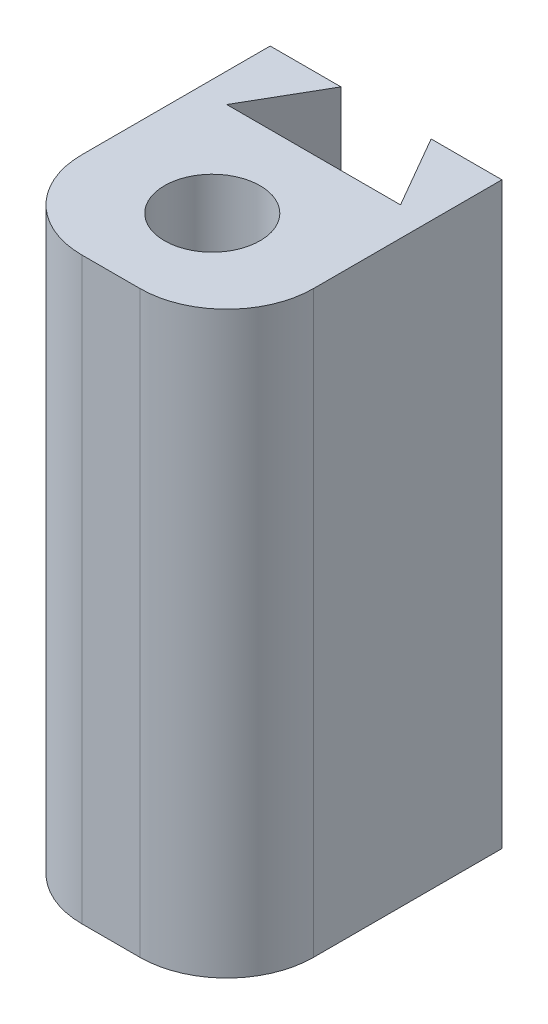
ISO-10303-21;
HEADER;
FILE_DESCRIPTION(('STEP AP214'),'2;1');
FILE_NAME('part.step','',(''),(''),'','','');
FILE_SCHEMA(('AUTOMOTIVE_DESIGN { 1 0 10303 214 1 1 1 1 }'));
ENDSEC;
DATA;
#1=APPLICATION_CONTEXT('core data for automotive mechanical design processes');
#2=APPLICATION_PROTOCOL_DEFINITION('international standard','automotive_design',2000,#1);
#3=PRODUCT_CONTEXT('',#1,'mechanical');
#4=PRODUCT('Part','Part','',(#3));
#5=PRODUCT_RELATED_PRODUCT_CATEGORY('part','',(#4));
#6=PRODUCT_DEFINITION_FORMATION('','',#4);
#7=PRODUCT_DEFINITION_CONTEXT('part definition',#1,'design');
#8=PRODUCT_DEFINITION('design','',#6,#7);
#9=PRODUCT_DEFINITION_SHAPE('','',#8);
#10=(LENGTH_UNIT() NAMED_UNIT(*) SI_UNIT(.MILLI.,.METRE.));
#11=(NAMED_UNIT(*) PLANE_ANGLE_UNIT() SI_UNIT($,.RADIAN.));
#12=(NAMED_UNIT(*) SI_UNIT($,.STERADIAN.) SOLID_ANGLE_UNIT());
#13=UNCERTAINTY_MEASURE_WITH_UNIT(LENGTH_MEASURE(1.E-05),#10,'distance_accuracy_value','');
#14=(GEOMETRIC_REPRESENTATION_CONTEXT(3) GLOBAL_UNCERTAINTY_ASSIGNED_CONTEXT((#13)) GLOBAL_UNIT_ASSIGNED_CONTEXT((#10,
#11,#12)) REPRESENTATION_CONTEXT('',''));
#15=CARTESIAN_POINT('',(0.,0.,0.));
#16=DIRECTION('',(0.,0.,1.));
#17=DIRECTION('',(1.,0.,0.));
#18=AXIS2_PLACEMENT_3D('',#15,#16,#17);
#19=CARTESIAN_POINT('',(0.,1.,-12.));
#20=DIRECTION('',(0.,0.,-1.));
#21=DIRECTION('',(-1.,0.,0.));
#22=AXIS2_PLACEMENT_3D('',#19,#20,#21);
#23=PLANE('',#22);
#24=DIRECTION('',(1.,0.,0.));
#25=VECTOR('',#24,1.);
#26=CARTESIAN_POINT('',(0.,-19.,-12.));
#27=LINE('',#26,#25);
#28=CARTESIAN_POINT('',(-4.00000000000001,-19.,-12.));
#29=VERTEX_POINT('',#28);
#30=CARTESIAN_POINT('',(-1.55662432702584,-19.,-12.));
#31=VERTEX_POINT('',#30);
#32=EDGE_CURVE('E124',#29,#31,#27,.T.);
#33=ORIENTED_EDGE('',*,*,#32,.F.);
#34=DIRECTION('',(0.,-1.,0.));
#35=VECTOR('',#34,1.);
#36=CARTESIAN_POINT('',(-4.00000000000001,1.,-12.));
#37=LINE('',#36,#35);
#38=CARTESIAN_POINT('',(-4.00000000000001,1.,-12.));
#39=VERTEX_POINT('',#38);
#40=EDGE_CURVE('E119',#39,#29,#37,.T.);
#41=ORIENTED_EDGE('',*,*,#40,.F.);
#42=DIRECTION('',(1.,0.,0.));
#43=VECTOR('',#42,1.);
#44=CARTESIAN_POINT('',(0.,1.,-12.));
#45=LINE('',#44,#43);
#46=CARTESIAN_POINT('',(-1.55662432702584,1.,-12.));
#47=VERTEX_POINT('',#46);
#48=EDGE_CURVE('E121',#39,#47,#45,.T.);
#49=ORIENTED_EDGE('',*,*,#48,.T.);
#50=DIRECTION('',(0.,-1.,0.));
#51=VECTOR('',#50,1.);
#52=CARTESIAN_POINT('',(-1.55662432702584,1.,-12.));
#53=LINE('',#52,#51);
#54=EDGE_CURVE('E158',#47,#31,#53,.T.);
#55=ORIENTED_EDGE('',*,*,#54,.T.);
#56=EDGE_LOOP('',(#33,#41,#49,#55));
#57=FACE_BOUND('',#56,.T.);
#58=ADVANCED_FACE('F40',(#57),#23,.T.);
#59=CARTESIAN_POINT('',(-4.00000000000001,1.,0.));
#60=DIRECTION('',(1.,0.,0.));
#61=DIRECTION('',(0.,0.,-1.));
#62=AXIS2_PLACEMENT_3D('',#59,#60,#61);
#63=PLANE('',#62);
#64=DIRECTION('',(0.,0.,1.));
#65=VECTOR('',#64,1.);
#66=CARTESIAN_POINT('',(-4.00000000000001,-19.,0.));
#67=LINE('',#66,#65);
#68=CARTESIAN_POINT('',(-4.00000000000001,-19.,-5.5));
#69=VERTEX_POINT('',#68);
#70=EDGE_CURVE('E160',#29,#69,#67,.T.);
#71=ORIENTED_EDGE('',*,*,#70,.T.);
#72=DIRECTION('',(0.,-1.,0.));
#73=VECTOR('',#72,1.);
#74=CARTESIAN_POINT('',(-4.00000000000001,1.,-5.5));
#75=LINE('',#74,#73);
#76=CARTESIAN_POINT('',(-4.00000000000001,1.,-5.5));
#77=VERTEX_POINT('',#76);
#78=EDGE_CURVE('E63',#69,#77,#75,.F.);
#79=ORIENTED_EDGE('',*,*,#78,.T.);
#80=DIRECTION('',(0.,0.,1.));
#81=VECTOR('',#80,1.);
#82=CARTESIAN_POINT('',(-4.00000000000001,1.,0.));
#83=LINE('',#82,#81);
#84=EDGE_CURVE('E129',#39,#77,#83,.T.);
#85=ORIENTED_EDGE('',*,*,#84,.F.);
#86=ORIENTED_EDGE('',*,*,#40,.T.);
#87=EDGE_LOOP('',(#71,#79,#85,#86));
#88=FACE_BOUND('',#87,.T.);
#89=ADVANCED_FACE('F130',(#88),#63,.F.);
#90=CARTESIAN_POINT('',(3.99999999999999,1.,0.));
#91=DIRECTION('',(1.,0.,0.));
#92=DIRECTION('',(0.,0.,-1.));
#93=AXIS2_PLACEMENT_3D('',#90,#91,#92);
#94=PLANE('',#93);
#95=DIRECTION('',(0.,0.,1.));
#96=VECTOR('',#95,1.);
#97=CARTESIAN_POINT('',(3.99999999999999,1.,0.));
#98=LINE('',#97,#96);
#99=CARTESIAN_POINT('',(3.99999999999999,1.,-12.));
#100=VERTEX_POINT('',#99);
#101=CARTESIAN_POINT('',(3.99999999999999,1.,-5.5));
#102=VERTEX_POINT('',#101);
#103=EDGE_CURVE('E132',#100,#102,#98,.T.);
#104=ORIENTED_EDGE('',*,*,#103,.T.);
#105=DIRECTION('',(0.,1.,0.));
#106=VECTOR('',#105,1.);
#107=CARTESIAN_POINT('',(3.99999999999999,1.,-5.5));
#108=LINE('',#107,#106);
#109=CARTESIAN_POINT('',(3.99999999999999,-19.,-5.5));
#110=VERTEX_POINT('',#109);
#111=EDGE_CURVE('E11',#102,#110,#108,.F.);
#112=ORIENTED_EDGE('',*,*,#111,.T.);
#113=DIRECTION('',(0.,0.,1.));
#114=VECTOR('',#113,1.);
#115=CARTESIAN_POINT('',(3.99999999999999,-19.,0.));
#116=LINE('',#115,#114);
#117=CARTESIAN_POINT('',(3.99999999999999,-19.,-12.));
#118=VERTEX_POINT('',#117);
#119=EDGE_CURVE('E162',#118,#110,#116,.T.);
#120=ORIENTED_EDGE('',*,*,#119,.F.);
#121=DIRECTION('',(0.,-1.,0.));
#122=VECTOR('',#121,1.);
#123=CARTESIAN_POINT('',(3.99999999999999,1.,-12.));
#124=LINE('',#123,#122);
#125=EDGE_CURVE('E127',#100,#118,#124,.T.);
#126=ORIENTED_EDGE('',*,*,#125,.F.);
#127=EDGE_LOOP('',(#104,#112,#120,#126));
#128=FACE_BOUND('',#127,.T.);
#129=ADVANCED_FACE('F232',(#128),#94,.T.);
#130=CARTESIAN_POINT('',(0.,1.,-12.));
#131=DIRECTION('',(0.,0.,-1.));
#132=DIRECTION('',(-1.,0.,0.));
#133=AXIS2_PLACEMENT_3D('',#130,#131,#132);
#134=PLANE('',#133);
#135=DIRECTION('',(1.,0.,0.));
#136=VECTOR('',#135,1.);
#137=CARTESIAN_POINT('',(0.,-19.,-12.));
#138=LINE('',#137,#136);
#139=CARTESIAN_POINT('',(1.55662432702604,-19.,-12.));
#140=VERTEX_POINT('',#139);
#141=EDGE_CURVE('E165',#140,#118,#138,.T.);
#142=ORIENTED_EDGE('',*,*,#141,.F.);
#143=DIRECTION('',(0.,-1.,0.));
#144=VECTOR('',#143,1.);
#145=CARTESIAN_POINT('',(1.55662432702604,1.,-12.));
#146=LINE('',#145,#144);
#147=CARTESIAN_POINT('',(1.55662432702604,1.,-12.));
#148=VERTEX_POINT('',#147);
#149=EDGE_CURVE('E178',#148,#140,#146,.T.);
#150=ORIENTED_EDGE('',*,*,#149,.F.);
#151=DIRECTION('',(1.,0.,0.));
#152=VECTOR('',#151,1.);
#153=CARTESIAN_POINT('',(0.,1.,-12.));
#154=LINE('',#153,#152);
#155=EDGE_CURVE('E148',#148,#100,#154,.T.);
#156=ORIENTED_EDGE('',*,*,#155,.T.);
#157=ORIENTED_EDGE('',*,*,#125,.T.);
#158=EDGE_LOOP('',(#142,#150,#156,#157));
#159=FACE_BOUND('',#158,.T.);
#160=ADVANCED_FACE('F268',(#159),#134,.T.);
#161=CARTESIAN_POINT('',(6.36362066797616,1.,-3.67403810567671));
#162=DIRECTION('',(-0.866025403784438,0.,0.500000000000001));
#163=DIRECTION('',(0.500000000000001,0.,0.866025403784438));
#164=AXIS2_PLACEMENT_3D('',#161,#162,#163);
#165=PLANE('',#164);
#166=DIRECTION('',(-0.500000000000001,0.,-0.866025403784438));
#167=VECTOR('',#166,1.);
#168=CARTESIAN_POINT('',(6.36362066797616,-19.,-3.67403810567671));
#169=LINE('',#168,#167);
#170=CARTESIAN_POINT('',(3.0000000000001,-19.,-9.5));
#171=VERTEX_POINT('',#170);
#172=EDGE_CURVE('E168',#171,#140,#169,.T.);
#173=ORIENTED_EDGE('',*,*,#172,.F.);
#174=DIRECTION('',(0.,-1.,0.));
#175=VECTOR('',#174,1.);
#176=CARTESIAN_POINT('',(3.0000000000001,1.,-9.5));
#177=LINE('',#176,#175);
#178=CARTESIAN_POINT('',(3.0000000000001,1.,-9.5));
#179=VERTEX_POINT('',#178);
#180=EDGE_CURVE('E176',#179,#171,#177,.T.);
#181=ORIENTED_EDGE('',*,*,#180,.F.);
#182=DIRECTION('',(-0.500000000000001,0.,-0.866025403784438));
#183=VECTOR('',#182,1.);
#184=CARTESIAN_POINT('',(6.36362066797616,1.,-3.67403810567671));
#185=LINE('',#184,#183);
#186=EDGE_CURVE('E151',#179,#148,#185,.T.);
#187=ORIENTED_EDGE('',*,*,#186,.T.);
#188=ORIENTED_EDGE('',*,*,#149,.T.);
#189=EDGE_LOOP('',(#173,#181,#187,#188));
#190=FACE_BOUND('',#189,.T.);
#191=ADVANCED_FACE('F298',(#190),#165,.T.);
#192=CARTESIAN_POINT('',(0.,1.,-9.5));
#193=DIRECTION('',(0.,0.,-1.));
#194=DIRECTION('',(-1.,0.,0.));
#195=AXIS2_PLACEMENT_3D('',#192,#193,#194);
#196=PLANE('',#195);
#197=DIRECTION('',(1.,0.,0.));
#198=VECTOR('',#197,1.);
#199=CARTESIAN_POINT('',(0.,-19.,-9.5));
#200=LINE('',#199,#198);
#201=CARTESIAN_POINT('',(-2.9999999999999,-19.,-9.5));
#202=VERTEX_POINT('',#201);
#203=EDGE_CURVE('E141',#202,#171,#200,.T.);
#204=ORIENTED_EDGE('',*,*,#203,.F.);
#205=DIRECTION('',(0.,-1.,0.));
#206=VECTOR('',#205,1.);
#207=CARTESIAN_POINT('',(-2.9999999999999,1.,-9.5));
#208=LINE('',#207,#206);
#209=CARTESIAN_POINT('',(-2.9999999999999,1.,-9.5));
#210=VERTEX_POINT('',#209);
#211=EDGE_CURVE('E174',#210,#202,#208,.T.);
#212=ORIENTED_EDGE('',*,*,#211,.F.);
#213=DIRECTION('',(1.,0.,0.));
#214=VECTOR('',#213,1.);
#215=CARTESIAN_POINT('',(0.,1.,-9.5));
#216=LINE('',#215,#214);
#217=EDGE_CURVE('E154',#210,#179,#216,.T.);
#218=ORIENTED_EDGE('',*,*,#217,.T.);
#219=ORIENTED_EDGE('',*,*,#180,.T.);
#220=EDGE_LOOP('',(#204,#212,#218,#219));
#221=FACE_BOUND('',#220,.T.);
#222=ADVANCED_FACE('F223',(#221),#196,.T.);
#223=CARTESIAN_POINT('',(-6.36362066797601,1.,-3.67403810567662));
#224=DIRECTION('',(0.866025403784439,0.,0.5));
#225=DIRECTION('',(0.5,0.,-0.866025403784439));
#226=AXIS2_PLACEMENT_3D('',#223,#224,#225);
#227=PLANE('',#226);
#228=DIRECTION('',(-0.5,0.,0.866025403784439));
#229=VECTOR('',#228,1.);
#230=CARTESIAN_POINT('',(-6.36362066797601,-19.,-3.67403810567662));
#231=LINE('',#230,#229);
#232=EDGE_CURVE('E138',#31,#202,#231,.T.);
#233=ORIENTED_EDGE('',*,*,#232,.F.);
#234=ORIENTED_EDGE('',*,*,#54,.F.);
#235=DIRECTION('',(-0.5,0.,0.866025403784439));
#236=VECTOR('',#235,1.);
#237=CARTESIAN_POINT('',(-6.36362066797601,1.,-3.67403810567662));
#238=LINE('',#237,#236);
#239=EDGE_CURVE('E137',#47,#210,#238,.T.);
#240=ORIENTED_EDGE('',*,*,#239,.T.);
#241=ORIENTED_EDGE('',*,*,#211,.T.);
#242=EDGE_LOOP('',(#233,#234,#240,#241));
#243=FACE_BOUND('',#242,.T.);
#244=ADVANCED_FACE('F215',(#243),#227,.T.);
#245=CARTESIAN_POINT('',(0.,1.,0.));
#246=DIRECTION('',(0.,1.,0.));
#247=DIRECTION('',(0.,0.,1.));
#248=AXIS2_PLACEMENT_3D('',#245,#246,#247);
#249=PLANE('',#248);
#250=CARTESIAN_POINT('',(0.,1.,-6.));
#251=DIRECTION('',(0.,1.,0.));
#252=DIRECTION('',(0.,0.,1.));
#253=AXIS2_PLACEMENT_3D('',#250,#251,#252);
#254=CIRCLE('',#253,1.64999999999999);
#255=CARTESIAN_POINT('',(0.,1.,-4.35000000000001));
#256=VERTEX_POINT('',#255);
#257=EDGE_CURVE('E206',#256,#256,#254,.T.);
#258=ORIENTED_EDGE('',*,*,#257,.F.);
#259=EDGE_LOOP('',(#258));
#260=FACE_BOUND('',#259,.T.);
#261=ORIENTED_EDGE('',*,*,#84,.T.);
#262=CARTESIAN_POINT('',(-1.00000000000001,1.,-5.5));
#263=DIRECTION('',(0.,1.,0.));
#264=DIRECTION('',(0.,0.,1.));
#265=AXIS2_PLACEMENT_3D('',#262,#263,#264);
#266=CIRCLE('',#265,3.);
#267=CARTESIAN_POINT('',(-1.00000000000001,1.,-2.5));
#268=VERTEX_POINT('',#267);
#269=EDGE_CURVE('E48',#77,#268,#266,.T.);
#270=ORIENTED_EDGE('',*,*,#269,.T.);
#271=DIRECTION('',(-1.,0.,0.));
#272=VECTOR('',#271,1.);
#273=CARTESIAN_POINT('',(3.99999999999999,1.,-2.5));
#274=LINE('',#273,#272);
#275=CARTESIAN_POINT('',(0.999999999999995,1.,-2.5));
#276=VERTEX_POINT('',#275);
#277=EDGE_CURVE('E144',#276,#268,#274,.T.);
#278=ORIENTED_EDGE('',*,*,#277,.F.);
#279=CARTESIAN_POINT('',(0.999999999999995,1.,-5.5));
#280=DIRECTION('',(0.,1.,0.));
#281=DIRECTION('',(0.,0.,1.));
#282=AXIS2_PLACEMENT_3D('',#279,#280,#281);
#283=CIRCLE('',#282,3.);
#284=EDGE_CURVE('E55',#276,#102,#283,.T.);
#285=ORIENTED_EDGE('',*,*,#284,.T.);
#286=ORIENTED_EDGE('',*,*,#103,.F.);
#287=ORIENTED_EDGE('',*,*,#155,.F.);
#288=ORIENTED_EDGE('',*,*,#186,.F.);
#289=ORIENTED_EDGE('',*,*,#217,.F.);
#290=ORIENTED_EDGE('',*,*,#239,.F.);
#291=ORIENTED_EDGE('',*,*,#48,.F.);
#292=EDGE_LOOP('',(#261,#270,#278,#285,#286,#287,#288,#289,#290,#291));
#293=FACE_BOUND('',#292,.T.);
#294=ADVANCED_FACE('F134',(#260,#293),#249,.T.);
#295=CARTESIAN_POINT('',(0.,-19.,0.));
#296=DIRECTION('',(0.,1.,0.));
#297=DIRECTION('',(0.,0.,1.));
#298=AXIS2_PLACEMENT_3D('',#295,#296,#297);
#299=PLANE('',#298);
#300=CARTESIAN_POINT('',(0.,-19.,-6.));
#301=DIRECTION('',(0.,1.,0.));
#302=DIRECTION('',(0.,0.,1.));
#303=AXIS2_PLACEMENT_3D('',#300,#301,#302);
#304=CIRCLE('',#303,1.64999999999999);
#305=CARTESIAN_POINT('',(0.,-19.,-4.35000000000001));
#306=VERTEX_POINT('',#305);
#307=EDGE_CURVE('E204',#306,#306,#304,.T.);
#308=ORIENTED_EDGE('',*,*,#307,.T.);
#309=EDGE_LOOP('',(#308));
#310=FACE_BOUND('',#309,.T.);
#311=DIRECTION('',(1.,0.,0.));
#312=VECTOR('',#311,1.);
#313=CARTESIAN_POINT('',(-4.00000000000001,-19.,-2.5));
#314=LINE('',#313,#312);
#315=CARTESIAN_POINT('',(-1.00000000000001,-19.,-2.5));
#316=VERTEX_POINT('',#315);
#317=CARTESIAN_POINT('',(0.999999999999995,-19.,-2.5));
#318=VERTEX_POINT('',#317);
#319=EDGE_CURVE('E199',#316,#318,#314,.T.);
#320=ORIENTED_EDGE('',*,*,#319,.F.);
#321=CARTESIAN_POINT('',(-1.00000000000001,-19.,-5.5));
#322=DIRECTION('',(0.,1.,0.));
#323=DIRECTION('',(0.,0.,1.));
#324=AXIS2_PLACEMENT_3D('',#321,#322,#323);
#325=CIRCLE('',#324,3.);
#326=EDGE_CURVE('E188',#316,#69,#325,.F.);
#327=ORIENTED_EDGE('',*,*,#326,.T.);
#328=ORIENTED_EDGE('',*,*,#70,.F.);
#329=ORIENTED_EDGE('',*,*,#32,.T.);
#330=ORIENTED_EDGE('',*,*,#232,.T.);
#331=ORIENTED_EDGE('',*,*,#203,.T.);
#332=ORIENTED_EDGE('',*,*,#172,.T.);
#333=ORIENTED_EDGE('',*,*,#141,.T.);
#334=ORIENTED_EDGE('',*,*,#119,.T.);
#335=CARTESIAN_POINT('',(0.999999999999995,-19.,-5.5));
#336=DIRECTION('',(0.,1.,0.));
#337=DIRECTION('',(0.,0.,1.));
#338=AXIS2_PLACEMENT_3D('',#335,#336,#337);
#339=CIRCLE('',#338,3.);
#340=EDGE_CURVE('E186',#110,#318,#339,.F.);
#341=ORIENTED_EDGE('',*,*,#340,.T.);
#342=EDGE_LOOP('',(#320,#327,#328,#329,#330,#331,#332,#333,#334,#341));
#343=FACE_BOUND('',#342,.T.);
#344=ADVANCED_FACE('F202',(#310,#343),#299,.F.);
#345=CARTESIAN_POINT('',(0.,0.,-2.5));
#346=DIRECTION('',(0.,0.,1.));
#347=DIRECTION('',(1.,0.,0.));
#348=AXIS2_PLACEMENT_3D('',#345,#346,#347);
#349=PLANE('',#348);
#350=ORIENTED_EDGE('',*,*,#277,.T.);
#351=DIRECTION('',(0.,-1.,0.));
#352=VECTOR('',#351,1.);
#353=CARTESIAN_POINT('',(-1.00000000000001,-19.,-2.5));
#354=LINE('',#353,#352);
#355=EDGE_CURVE('E183',#268,#316,#354,.T.);
#356=ORIENTED_EDGE('',*,*,#355,.T.);
#357=ORIENTED_EDGE('',*,*,#319,.T.);
#358=DIRECTION('',(0.,1.,0.));
#359=VECTOR('',#358,1.);
#360=CARTESIAN_POINT('',(0.999999999999995,0.,-2.5));
#361=LINE('',#360,#359);
#362=EDGE_CURVE('E126',#318,#276,#361,.T.);
#363=ORIENTED_EDGE('',*,*,#362,.T.);
#364=EDGE_LOOP('',(#350,#356,#357,#363));
#365=FACE_BOUND('',#364,.T.);
#366=ADVANCED_FACE('F195',(#365),#349,.T.);
#367=CARTESIAN_POINT('',(0.,1.,-6.));
#368=DIRECTION('',(0.,1.,0.));
#369=DIRECTION('',(0.,0.,1.));
#370=AXIS2_PLACEMENT_3D('',#367,#368,#369);
#371=CYLINDRICAL_SURFACE('',#370,1.64999999999999);
#372=ORIENTED_EDGE('',*,*,#307,.F.);
#373=EDGE_LOOP('',(#372));
#374=FACE_BOUND('',#373,.T.);
#375=ORIENTED_EDGE('',*,*,#257,.T.);
#376=EDGE_LOOP('',(#375));
#377=FACE_BOUND('',#376,.T.);
#378=ADVANCED_FACE('F212',(#374,#377),#371,.F.);
#379=CARTESIAN_POINT('',(-1.00000000000001,0.,-5.5));
#380=DIRECTION('',(0.,1.,0.));
#381=DIRECTION('',(0.,0.,1.));
#382=AXIS2_PLACEMENT_3D('',#379,#380,#381);
#383=CYLINDRICAL_SURFACE('',#382,3.);
#384=ORIENTED_EDGE('',*,*,#269,.F.);
#385=ORIENTED_EDGE('',*,*,#78,.F.);
#386=ORIENTED_EDGE('',*,*,#326,.F.);
#387=ORIENTED_EDGE('',*,*,#355,.F.);
#388=EDGE_LOOP('',(#384,#385,#386,#387));
#389=FACE_BOUND('',#388,.T.);
#390=ADVANCED_FACE('F200',(#389),#383,.T.);
#391=CARTESIAN_POINT('',(0.999999999999995,0.,-5.5));
#392=DIRECTION('',(0.,1.,0.));
#393=DIRECTION('',(0.,0.,1.));
#394=AXIS2_PLACEMENT_3D('',#391,#392,#393);
#395=CYLINDRICAL_SURFACE('',#394,3.);
#396=ORIENTED_EDGE('',*,*,#340,.F.);
#397=ORIENTED_EDGE('',*,*,#111,.F.);
#398=ORIENTED_EDGE('',*,*,#284,.F.);
#399=ORIENTED_EDGE('',*,*,#362,.F.);
#400=EDGE_LOOP('',(#396,#397,#398,#399));
#401=FACE_BOUND('',#400,.T.);
#402=ADVANCED_FACE('F42',(#401),#395,.T.);
#403=CLOSED_SHELL('',(#58,#89,#129,#160,#191,#222,#244,#294,#344,#366,#378,#390,#402));
#404=MANIFOLD_SOLID_BREP('B2',#403);
#405=ADVANCED_BREP_SHAPE_REPRESENTATION('',(#18,#404),#14);
#406=SHAPE_DEFINITION_REPRESENTATION(#9,#405);
ENDSEC;
END-ISO-10303-21;
